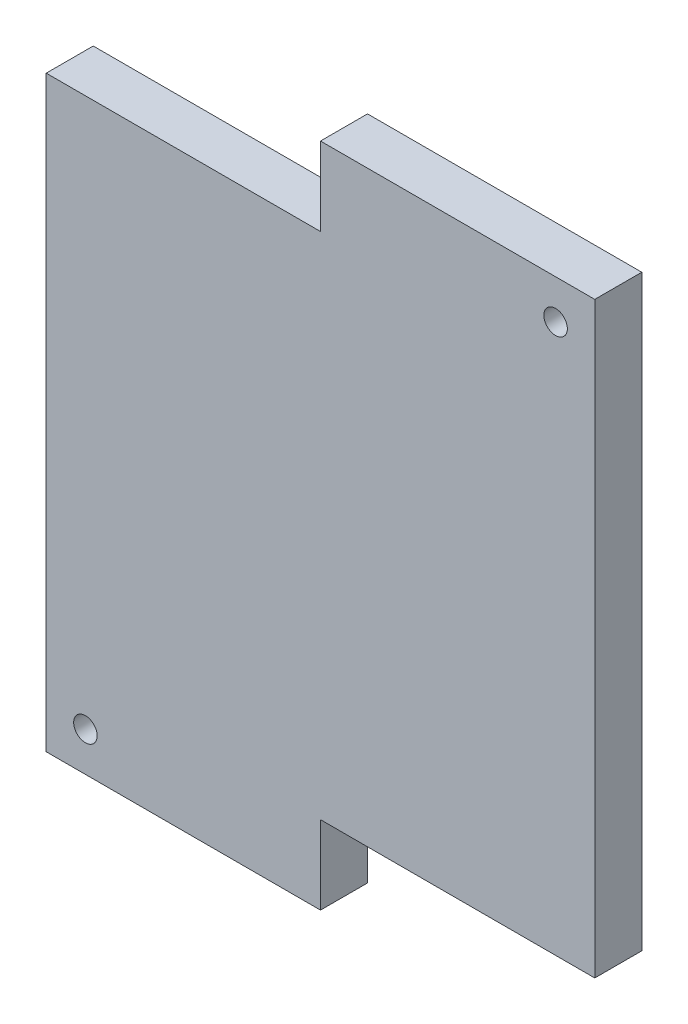
ISO-10303-21;
HEADER;
FILE_DESCRIPTION(('STEP AP214'),'2;1');
FILE_NAME('part.step','',(''),(''),'','','');
FILE_SCHEMA(('AUTOMOTIVE_DESIGN { 1 0 10303 214 1 1 1 1 }'));
ENDSEC;
DATA;
#1=APPLICATION_CONTEXT('core data for automotive mechanical design processes');
#2=APPLICATION_PROTOCOL_DEFINITION('international standard','automotive_design',2000,#1);
#3=PRODUCT_CONTEXT('',#1,'mechanical');
#4=PRODUCT('Part','Part','',(#3));
#5=PRODUCT_RELATED_PRODUCT_CATEGORY('part','',(#4));
#6=PRODUCT_DEFINITION_FORMATION('','',#4);
#7=PRODUCT_DEFINITION_CONTEXT('part definition',#1,'design');
#8=PRODUCT_DEFINITION('design','',#6,#7);
#9=PRODUCT_DEFINITION_SHAPE('','',#8);
#10=(LENGTH_UNIT() NAMED_UNIT(*) SI_UNIT(.MILLI.,.METRE.));
#11=(NAMED_UNIT(*) PLANE_ANGLE_UNIT() SI_UNIT($,.RADIAN.));
#12=(NAMED_UNIT(*) SI_UNIT($,.STERADIAN.) SOLID_ANGLE_UNIT());
#13=UNCERTAINTY_MEASURE_WITH_UNIT(LENGTH_MEASURE(1.E-05),#10,'distance_accuracy_value','');
#14=(GEOMETRIC_REPRESENTATION_CONTEXT(3) GLOBAL_UNCERTAINTY_ASSIGNED_CONTEXT((#13)) GLOBAL_UNIT_ASSIGNED_CONTEXT((#10,
#11,#12)) REPRESENTATION_CONTEXT('',''));
#15=CARTESIAN_POINT('',(0.,0.,0.));
#16=DIRECTION('',(0.,0.,1.));
#17=DIRECTION('',(1.,0.,0.));
#18=AXIS2_PLACEMENT_3D('',#15,#16,#17);
#19=CARTESIAN_POINT('',(0.,0.,6.));
#20=DIRECTION('',(0.,0.,-1.));
#21=DIRECTION('',(-1.,0.,0.));
#22=AXIS2_PLACEMENT_3D('',#19,#20,#21);
#23=PLANE('',#22);
#24=DIRECTION('',(0.,-1.,0.));
#25=VECTOR('',#24,1.);
#26=CARTESIAN_POINT('',(0.,0.,6.));
#27=LINE('',#26,#25);
#28=CARTESIAN_POINT('',(0.,75.,6.));
#29=VERTEX_POINT('',#28);
#30=CARTESIAN_POINT('',(0.,0.,6.));
#31=VERTEX_POINT('',#30);
#32=EDGE_CURVE('E147',#29,#31,#27,.T.);
#33=ORIENTED_EDGE('',*,*,#32,.T.);
#34=DIRECTION('',(1.,0.,0.));
#35=VECTOR('',#34,1.);
#36=CARTESIAN_POINT('',(0.,0.,6.));
#37=LINE('',#36,#35);
#38=CARTESIAN_POINT('',(35.,0.,6.));
#39=VERTEX_POINT('',#38);
#40=EDGE_CURVE('E95',#31,#39,#37,.T.);
#41=ORIENTED_EDGE('',*,*,#40,.T.);
#42=DIRECTION('',(0.,1.,0.));
#43=VECTOR('',#42,1.);
#44=CARTESIAN_POINT('',(35.,0.,6.));
#45=LINE('',#44,#43);
#46=CARTESIAN_POINT('',(35.,10.,6.));
#47=VERTEX_POINT('',#46);
#48=EDGE_CURVE('E162',#39,#47,#45,.T.);
#49=ORIENTED_EDGE('',*,*,#48,.T.);
#50=DIRECTION('',(1.,0.,0.));
#51=VECTOR('',#50,1.);
#52=CARTESIAN_POINT('',(70.,10.,6.));
#53=LINE('',#52,#51);
#54=CARTESIAN_POINT('',(70.,10.,6.));
#55=VERTEX_POINT('',#54);
#56=EDGE_CURVE('E175',#47,#55,#53,.T.);
#57=ORIENTED_EDGE('',*,*,#56,.T.);
#58=DIRECTION('',(0.,1.,0.));
#59=VECTOR('',#58,1.);
#60=CARTESIAN_POINT('',(70.,10.,6.));
#61=LINE('',#60,#59);
#62=CARTESIAN_POINT('',(70.,85.,6.));
#63=VERTEX_POINT('',#62);
#64=EDGE_CURVE('E114',#55,#63,#61,.T.);
#65=ORIENTED_EDGE('',*,*,#64,.T.);
#66=DIRECTION('',(-1.,0.,0.));
#67=VECTOR('',#66,1.);
#68=CARTESIAN_POINT('',(35.,85.,6.));
#69=LINE('',#68,#67);
#70=CARTESIAN_POINT('',(35.,85.,6.));
#71=VERTEX_POINT('',#70);
#72=EDGE_CURVE('E108',#63,#71,#69,.T.);
#73=ORIENTED_EDGE('',*,*,#72,.T.);
#74=DIRECTION('',(0.,-1.,0.));
#75=VECTOR('',#74,1.);
#76=CARTESIAN_POINT('',(35.,85.,6.));
#77=LINE('',#76,#75);
#78=CARTESIAN_POINT('',(35.,75.,6.));
#79=VERTEX_POINT('',#78);
#80=EDGE_CURVE('E112',#71,#79,#77,.T.);
#81=ORIENTED_EDGE('',*,*,#80,.T.);
#82=DIRECTION('',(-1.,0.,0.));
#83=VECTOR('',#82,1.);
#84=CARTESIAN_POINT('',(0.,75.,6.));
#85=LINE('',#84,#83);
#86=EDGE_CURVE('E52',#79,#29,#85,.T.);
#87=ORIENTED_EDGE('',*,*,#86,.T.);
#88=EDGE_LOOP('',(#33,#41,#49,#57,#65,#73,#81,#87));
#89=FACE_BOUND('',#88,.T.);
#90=CARTESIAN_POINT('',(65.,80.,6.));
#91=DIRECTION('',(0.,0.,1.));
#92=DIRECTION('',(1.,0.,0.));
#93=AXIS2_PLACEMENT_3D('',#90,#91,#92);
#94=CIRCLE('',#93,1.5);
#95=CARTESIAN_POINT('',(66.5,80.,6.));
#96=VERTEX_POINT('',#95);
#97=EDGE_CURVE('E136',#96,#96,#94,.T.);
#98=ORIENTED_EDGE('',*,*,#97,.F.);
#99=EDGE_LOOP('',(#98));
#100=FACE_BOUND('',#99,.T.);
#101=CARTESIAN_POINT('',(5.,5.,6.));
#102=DIRECTION('',(0.,0.,1.));
#103=DIRECTION('',(1.,0.,0.));
#104=AXIS2_PLACEMENT_3D('',#101,#102,#103);
#105=CIRCLE('',#104,1.5);
#106=CARTESIAN_POINT('',(6.5,5.,6.));
#107=VERTEX_POINT('',#106);
#108=EDGE_CURVE('E184',#107,#107,#105,.T.);
#109=ORIENTED_EDGE('',*,*,#108,.F.);
#110=EDGE_LOOP('',(#109));
#111=FACE_BOUND('',#110,.T.);
#112=ADVANCED_FACE('F35',(#89,#100,#111),#23,.F.);
#113=CARTESIAN_POINT('',(0.,0.,0.));
#114=DIRECTION('',(0.,0.,-1.));
#115=DIRECTION('',(-1.,0.,0.));
#116=AXIS2_PLACEMENT_3D('',#113,#114,#115);
#117=PLANE('',#116);
#118=CARTESIAN_POINT('',(65.,80.,0.));
#119=DIRECTION('',(0.,0.,1.));
#120=DIRECTION('',(1.,0.,0.));
#121=AXIS2_PLACEMENT_3D('',#118,#119,#120);
#122=CIRCLE('',#121,1.5);
#123=CARTESIAN_POINT('',(66.5,80.,0.));
#124=VERTEX_POINT('',#123);
#125=EDGE_CURVE('E181',#124,#124,#122,.T.);
#126=ORIENTED_EDGE('',*,*,#125,.T.);
#127=EDGE_LOOP('',(#126));
#128=FACE_BOUND('',#127,.T.);
#129=DIRECTION('',(0.,-1.,0.));
#130=VECTOR('',#129,1.);
#131=CARTESIAN_POINT('',(0.,0.,0.));
#132=LINE('',#131,#130);
#133=CARTESIAN_POINT('',(0.,75.,0.));
#134=VERTEX_POINT('',#133);
#135=CARTESIAN_POINT('',(0.,0.,0.));
#136=VERTEX_POINT('',#135);
#137=EDGE_CURVE('E132',#134,#136,#132,.T.);
#138=ORIENTED_EDGE('',*,*,#137,.F.);
#139=DIRECTION('',(-1.,0.,0.));
#140=VECTOR('',#139,1.);
#141=CARTESIAN_POINT('',(0.,75.,0.));
#142=LINE('',#141,#140);
#143=CARTESIAN_POINT('',(35.,75.,0.));
#144=VERTEX_POINT('',#143);
#145=EDGE_CURVE('E87',#144,#134,#142,.T.);
#146=ORIENTED_EDGE('',*,*,#145,.F.);
#147=DIRECTION('',(0.,-1.,0.));
#148=VECTOR('',#147,1.);
#149=CARTESIAN_POINT('',(35.,85.,0.));
#150=LINE('',#149,#148);
#151=CARTESIAN_POINT('',(35.,85.,0.));
#152=VERTEX_POINT('',#151);
#153=EDGE_CURVE('E81',#152,#144,#150,.T.);
#154=ORIENTED_EDGE('',*,*,#153,.F.);
#155=DIRECTION('',(-1.,0.,0.));
#156=VECTOR('',#155,1.);
#157=CARTESIAN_POINT('',(35.,85.,0.));
#158=LINE('',#157,#156);
#159=CARTESIAN_POINT('',(70.,85.,0.));
#160=VERTEX_POINT('',#159);
#161=EDGE_CURVE('E122',#160,#152,#158,.T.);
#162=ORIENTED_EDGE('',*,*,#161,.F.);
#163=DIRECTION('',(0.,1.,0.));
#164=VECTOR('',#163,1.);
#165=CARTESIAN_POINT('',(70.,10.,0.));
#166=LINE('',#165,#164);
#167=CARTESIAN_POINT('',(70.,10.,0.));
#168=VERTEX_POINT('',#167);
#169=EDGE_CURVE('E142',#168,#160,#166,.T.);
#170=ORIENTED_EDGE('',*,*,#169,.F.);
#171=DIRECTION('',(1.,0.,0.));
#172=VECTOR('',#171,1.);
#173=CARTESIAN_POINT('',(70.,10.,0.));
#174=LINE('',#173,#172);
#175=CARTESIAN_POINT('',(35.,10.,0.));
#176=VERTEX_POINT('',#175);
#177=EDGE_CURVE('E140',#176,#168,#174,.T.);
#178=ORIENTED_EDGE('',*,*,#177,.F.);
#179=DIRECTION('',(0.,1.,0.));
#180=VECTOR('',#179,1.);
#181=CARTESIAN_POINT('',(35.,0.,0.));
#182=LINE('',#181,#180);
#183=CARTESIAN_POINT('',(35.,0.,0.));
#184=VERTEX_POINT('',#183);
#185=EDGE_CURVE('E138',#184,#176,#182,.T.);
#186=ORIENTED_EDGE('',*,*,#185,.F.);
#187=DIRECTION('',(1.,0.,0.));
#188=VECTOR('',#187,1.);
#189=CARTESIAN_POINT('',(0.,0.,0.));
#190=LINE('',#189,#188);
#191=EDGE_CURVE('E135',#136,#184,#190,.T.);
#192=ORIENTED_EDGE('',*,*,#191,.F.);
#193=EDGE_LOOP('',(#138,#146,#154,#162,#170,#178,#186,#192));
#194=FACE_BOUND('',#193,.T.);
#195=CARTESIAN_POINT('',(5.,5.,0.));
#196=DIRECTION('',(0.,0.,1.));
#197=DIRECTION('',(1.,0.,0.));
#198=AXIS2_PLACEMENT_3D('',#195,#196,#197);
#199=CIRCLE('',#198,1.5);
#200=CARTESIAN_POINT('',(6.5,5.,0.));
#201=VERTEX_POINT('',#200);
#202=EDGE_CURVE('E187',#201,#201,#199,.T.);
#203=ORIENTED_EDGE('',*,*,#202,.T.);
#204=EDGE_LOOP('',(#203));
#205=FACE_BOUND('',#204,.T.);
#206=ADVANCED_FACE('F166',(#128,#194,#205),#117,.T.);
#207=CARTESIAN_POINT('',(0.,0.,6.));
#208=DIRECTION('',(1.,0.,0.));
#209=DIRECTION('',(0.,0.,-1.));
#210=AXIS2_PLACEMENT_3D('',#207,#208,#209);
#211=PLANE('',#210);
#212=ORIENTED_EDGE('',*,*,#137,.T.);
#213=DIRECTION('',(0.,0.,-1.));
#214=VECTOR('',#213,1.);
#215=CARTESIAN_POINT('',(0.,0.,6.));
#216=LINE('',#215,#214);
#217=EDGE_CURVE('E11',#31,#136,#216,.T.);
#218=ORIENTED_EDGE('',*,*,#217,.F.);
#219=ORIENTED_EDGE('',*,*,#32,.F.);
#220=DIRECTION('',(0.,0.,-1.));
#221=VECTOR('',#220,1.);
#222=CARTESIAN_POINT('',(0.,75.,6.));
#223=LINE('',#222,#221);
#224=EDGE_CURVE('E128',#29,#134,#223,.T.);
#225=ORIENTED_EDGE('',*,*,#224,.T.);
#226=EDGE_LOOP('',(#212,#218,#219,#225));
#227=FACE_BOUND('',#226,.T.);
#228=ADVANCED_FACE('F37',(#227),#211,.F.);
#229=CARTESIAN_POINT('',(0.,0.,6.));
#230=DIRECTION('',(0.,1.,0.));
#231=DIRECTION('',(0.,0.,1.));
#232=AXIS2_PLACEMENT_3D('',#229,#230,#231);
#233=PLANE('',#232);
#234=ORIENTED_EDGE('',*,*,#191,.T.);
#235=DIRECTION('',(0.,0.,-1.));
#236=VECTOR('',#235,1.);
#237=CARTESIAN_POINT('',(35.,0.,6.));
#238=LINE('',#237,#236);
#239=EDGE_CURVE('E44',#39,#184,#238,.T.);
#240=ORIENTED_EDGE('',*,*,#239,.F.);
#241=ORIENTED_EDGE('',*,*,#40,.F.);
#242=ORIENTED_EDGE('',*,*,#217,.T.);
#243=EDGE_LOOP('',(#234,#240,#241,#242));
#244=FACE_BOUND('',#243,.T.);
#245=ADVANCED_FACE('F219',(#244),#233,.F.);
#246=CARTESIAN_POINT('',(35.,0.,6.));
#247=DIRECTION('',(-1.,0.,0.));
#248=DIRECTION('',(0.,0.,1.));
#249=AXIS2_PLACEMENT_3D('',#246,#247,#248);
#250=PLANE('',#249);
#251=ORIENTED_EDGE('',*,*,#185,.T.);
#252=DIRECTION('',(0.,0.,-1.));
#253=VECTOR('',#252,1.);
#254=CARTESIAN_POINT('',(35.,10.,6.));
#255=LINE('',#254,#253);
#256=EDGE_CURVE('E154',#47,#176,#255,.T.);
#257=ORIENTED_EDGE('',*,*,#256,.F.);
#258=ORIENTED_EDGE('',*,*,#48,.F.);
#259=ORIENTED_EDGE('',*,*,#239,.T.);
#260=EDGE_LOOP('',(#251,#257,#258,#259));
#261=FACE_BOUND('',#260,.T.);
#262=ADVANCED_FACE('F160',(#261),#250,.F.);
#263=CARTESIAN_POINT('',(70.,10.,6.));
#264=DIRECTION('',(0.,1.,0.));
#265=DIRECTION('',(0.,0.,1.));
#266=AXIS2_PLACEMENT_3D('',#263,#264,#265);
#267=PLANE('',#266);
#268=ORIENTED_EDGE('',*,*,#177,.T.);
#269=DIRECTION('',(0.,0.,-1.));
#270=VECTOR('',#269,1.);
#271=CARTESIAN_POINT('',(70.,10.,6.));
#272=LINE('',#271,#270);
#273=EDGE_CURVE('E151',#55,#168,#272,.T.);
#274=ORIENTED_EDGE('',*,*,#273,.F.);
#275=ORIENTED_EDGE('',*,*,#56,.F.);
#276=ORIENTED_EDGE('',*,*,#256,.T.);
#277=EDGE_LOOP('',(#268,#274,#275,#276));
#278=FACE_BOUND('',#277,.T.);
#279=ADVANCED_FACE('F171',(#278),#267,.F.);
#280=CARTESIAN_POINT('',(70.,10.,6.));
#281=DIRECTION('',(-1.,0.,0.));
#282=DIRECTION('',(0.,0.,1.));
#283=AXIS2_PLACEMENT_3D('',#280,#281,#282);
#284=PLANE('',#283);
#285=ORIENTED_EDGE('',*,*,#169,.T.);
#286=DIRECTION('',(0.,0.,-1.));
#287=VECTOR('',#286,1.);
#288=CARTESIAN_POINT('',(70.,85.,6.));
#289=LINE('',#288,#287);
#290=EDGE_CURVE('E123',#63,#160,#289,.T.);
#291=ORIENTED_EDGE('',*,*,#290,.F.);
#292=ORIENTED_EDGE('',*,*,#64,.F.);
#293=ORIENTED_EDGE('',*,*,#273,.T.);
#294=EDGE_LOOP('',(#285,#291,#292,#293));
#295=FACE_BOUND('',#294,.T.);
#296=ADVANCED_FACE('F174',(#295),#284,.F.);
#297=CARTESIAN_POINT('',(35.,85.,6.));
#298=DIRECTION('',(0.,-1.,0.));
#299=DIRECTION('',(1.,0.,0.));
#300=AXIS2_PLACEMENT_3D('',#297,#298,#299);
#301=PLANE('',#300);
#302=ORIENTED_EDGE('',*,*,#161,.T.);
#303=DIRECTION('',(0.,0.,-1.));
#304=VECTOR('',#303,1.);
#305=CARTESIAN_POINT('',(35.,85.,6.));
#306=LINE('',#305,#304);
#307=EDGE_CURVE('E119',#71,#152,#306,.T.);
#308=ORIENTED_EDGE('',*,*,#307,.F.);
#309=ORIENTED_EDGE('',*,*,#72,.F.);
#310=ORIENTED_EDGE('',*,*,#290,.T.);
#311=EDGE_LOOP('',(#302,#308,#309,#310));
#312=FACE_BOUND('',#311,.T.);
#313=ADVANCED_FACE('F120',(#312),#301,.F.);
#314=CARTESIAN_POINT('',(35.,85.,6.));
#315=DIRECTION('',(1.,0.,0.));
#316=DIRECTION('',(0.,0.,-1.));
#317=AXIS2_PLACEMENT_3D('',#314,#315,#316);
#318=PLANE('',#317);
#319=ORIENTED_EDGE('',*,*,#153,.T.);
#320=DIRECTION('',(0.,0.,-1.));
#321=VECTOR('',#320,1.);
#322=CARTESIAN_POINT('',(35.,75.,6.));
#323=LINE('',#322,#321);
#324=EDGE_CURVE('E124',#79,#144,#323,.T.);
#325=ORIENTED_EDGE('',*,*,#324,.F.);
#326=ORIENTED_EDGE('',*,*,#80,.F.);
#327=ORIENTED_EDGE('',*,*,#307,.T.);
#328=EDGE_LOOP('',(#319,#325,#326,#327));
#329=FACE_BOUND('',#328,.T.);
#330=ADVANCED_FACE('F126',(#329),#318,.F.);
#331=CARTESIAN_POINT('',(0.,75.,6.));
#332=DIRECTION('',(0.,-1.,0.));
#333=DIRECTION('',(0.,0.,-1.));
#334=AXIS2_PLACEMENT_3D('',#331,#332,#333);
#335=PLANE('',#334);
#336=ORIENTED_EDGE('',*,*,#145,.T.);
#337=ORIENTED_EDGE('',*,*,#224,.F.);
#338=ORIENTED_EDGE('',*,*,#86,.F.);
#339=ORIENTED_EDGE('',*,*,#324,.T.);
#340=EDGE_LOOP('',(#336,#337,#338,#339));
#341=FACE_BOUND('',#340,.T.);
#342=ADVANCED_FACE('F207',(#341),#335,.F.);
#343=CARTESIAN_POINT('',(65.,80.,6.));
#344=DIRECTION('',(0.,0.,-1.));
#345=DIRECTION('',(-1.,0.,0.));
#346=AXIS2_PLACEMENT_3D('',#343,#344,#345);
#347=CYLINDRICAL_SURFACE('',#346,1.5);
#348=ORIENTED_EDGE('',*,*,#97,.T.);
#349=EDGE_LOOP('',(#348));
#350=FACE_BOUND('',#349,.T.);
#351=ORIENTED_EDGE('',*,*,#125,.F.);
#352=EDGE_LOOP('',(#351));
#353=FACE_BOUND('',#352,.T.);
#354=ADVANCED_FACE('F204',(#350,#353),#347,.F.);
#355=CARTESIAN_POINT('',(5.,5.,6.));
#356=DIRECTION('',(0.,0.,-1.));
#357=DIRECTION('',(-1.,0.,0.));
#358=AXIS2_PLACEMENT_3D('',#355,#356,#357);
#359=CYLINDRICAL_SURFACE('',#358,1.5);
#360=ORIENTED_EDGE('',*,*,#108,.T.);
#361=EDGE_LOOP('',(#360));
#362=FACE_BOUND('',#361,.T.);
#363=ORIENTED_EDGE('',*,*,#202,.F.);
#364=EDGE_LOOP('',(#363));
#365=FACE_BOUND('',#364,.T.);
#366=ADVANCED_FACE('F193',(#362,#365),#359,.F.);
#367=CLOSED_SHELL('',(#112,#206,#228,#245,#262,#279,#296,#313,#330,#342,#354,#366));
#368=MANIFOLD_SOLID_BREP('B2',#367);
#369=ADVANCED_BREP_SHAPE_REPRESENTATION('',(#18,#368),#14);
#370=SHAPE_DEFINITION_REPRESENTATION(#9,#369);
ENDSEC;
END-ISO-10303-21;
